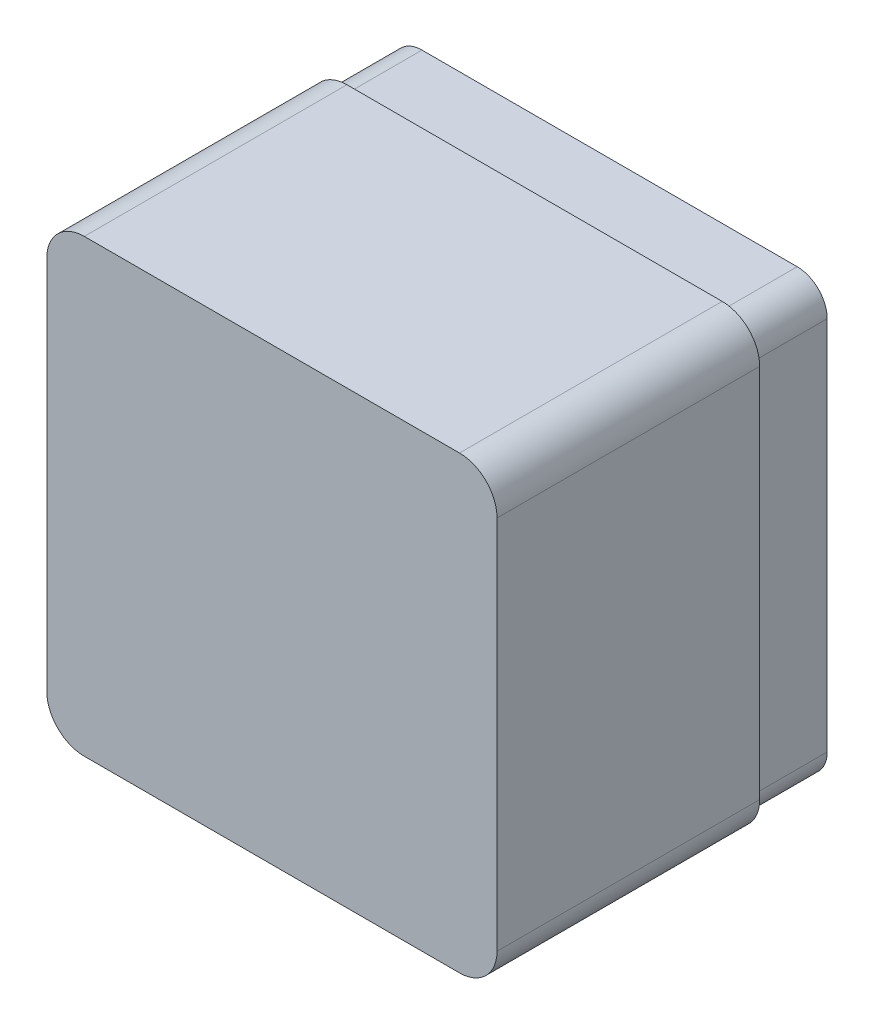
ISO-10303-21;
HEADER;
FILE_DESCRIPTION(('STEP AP214'),'2;1');
FILE_NAME('part.step','',(''),(''),'','','');
FILE_SCHEMA(('AUTOMOTIVE_DESIGN { 1 0 10303 214 1 1 1 1 }'));
ENDSEC;
DATA;
#1=APPLICATION_CONTEXT('core data for automotive mechanical design processes');
#2=APPLICATION_PROTOCOL_DEFINITION('international standard','automotive_design',2000,#1);
#3=PRODUCT_CONTEXT('',#1,'mechanical');
#4=PRODUCT('Part','Part','',(#3));
#5=PRODUCT_RELATED_PRODUCT_CATEGORY('part','',(#4));
#6=PRODUCT_DEFINITION_FORMATION('','',#4);
#7=PRODUCT_DEFINITION_CONTEXT('part definition',#1,'design');
#8=PRODUCT_DEFINITION('design','',#6,#7);
#9=PRODUCT_DEFINITION_SHAPE('','',#8);
#10=(LENGTH_UNIT() NAMED_UNIT(*) SI_UNIT(.MILLI.,.METRE.));
#11=(NAMED_UNIT(*) PLANE_ANGLE_UNIT() SI_UNIT($,.RADIAN.));
#12=(NAMED_UNIT(*) SI_UNIT($,.STERADIAN.) SOLID_ANGLE_UNIT());
#13=UNCERTAINTY_MEASURE_WITH_UNIT(LENGTH_MEASURE(1.E-05),#10,'distance_accuracy_value','');
#14=(GEOMETRIC_REPRESENTATION_CONTEXT(3) GLOBAL_UNCERTAINTY_ASSIGNED_CONTEXT((#13)) GLOBAL_UNIT_ASSIGNED_CONTEXT((#10,
#11,#12)) REPRESENTATION_CONTEXT('',''));
#15=CARTESIAN_POINT('',(0.,0.,0.));
#16=DIRECTION('',(0.,0.,1.));
#17=DIRECTION('',(1.,0.,0.));
#18=AXIS2_PLACEMENT_3D('',#15,#16,#17);
#19=CARTESIAN_POINT('',(0.,0.,0.));
#20=DIRECTION('',(0.,0.,-1.));
#21=DIRECTION('',(-1.,0.,0.));
#22=AXIS2_PLACEMENT_3D('',#19,#20,#21);
#23=PLANE('',#22);
#24=CARTESIAN_POINT('',(10.,10.,0.));
#25=DIRECTION('',(0.,0.,-1.));
#26=DIRECTION('',(-1.,0.,0.));
#27=AXIS2_PLACEMENT_3D('',#24,#25,#26);
#28=CIRCLE('',#27,6.);
#29=CARTESIAN_POINT('',(10.,4.,0.));
#30=VERTEX_POINT('',#29);
#31=CARTESIAN_POINT('',(4.,9.99999999999999,0.));
#32=VERTEX_POINT('',#31);
#33=EDGE_CURVE('E371',#30,#32,#28,.T.);
#34=ORIENTED_EDGE('',*,*,#33,.F.);
#35=DIRECTION('',(1.,0.,0.));
#36=VECTOR('',#35,1.);
#37=CARTESIAN_POINT('',(0.,4.,0.));
#38=LINE('',#37,#36);
#39=CARTESIAN_POINT('',(110.,4.,0.));
#40=VERTEX_POINT('',#39);
#41=EDGE_CURVE('E418',#30,#40,#38,.T.);
#42=ORIENTED_EDGE('',*,*,#41,.T.);
#43=CARTESIAN_POINT('',(110.,10.,0.));
#44=DIRECTION('',(0.,0.,-1.));
#45=DIRECTION('',(-1.,0.,0.));
#46=AXIS2_PLACEMENT_3D('',#43,#44,#45);
#47=CIRCLE('',#46,6.);
#48=CARTESIAN_POINT('',(116.,10.,0.));
#49=VERTEX_POINT('',#48);
#50=EDGE_CURVE('E428',#49,#40,#47,.T.);
#51=ORIENTED_EDGE('',*,*,#50,.F.);
#52=DIRECTION('',(0.,1.,0.));
#53=VECTOR('',#52,1.);
#54=CARTESIAN_POINT('',(116.,0.,0.));
#55=LINE('',#54,#53);
#56=CARTESIAN_POINT('',(116.,110.,0.));
#57=VERTEX_POINT('',#56);
#58=EDGE_CURVE('E425',#49,#57,#55,.T.);
#59=ORIENTED_EDGE('',*,*,#58,.T.);
#60=CARTESIAN_POINT('',(110.,110.,0.));
#61=DIRECTION('',(0.,0.,-1.));
#62=DIRECTION('',(-1.,0.,0.));
#63=AXIS2_PLACEMENT_3D('',#60,#61,#62);
#64=CIRCLE('',#63,6.);
#65=CARTESIAN_POINT('',(110.,116.,0.));
#66=VERTEX_POINT('',#65);
#67=EDGE_CURVE('E421',#66,#57,#64,.T.);
#68=ORIENTED_EDGE('',*,*,#67,.F.);
#69=DIRECTION('',(-1.,0.,0.));
#70=VECTOR('',#69,1.);
#71=CARTESIAN_POINT('',(0.,116.,0.));
#72=LINE('',#71,#70);
#73=CARTESIAN_POINT('',(9.99999999999999,116.,0.));
#74=VERTEX_POINT('',#73);
#75=EDGE_CURVE('E368',#66,#74,#72,.T.);
#76=ORIENTED_EDGE('',*,*,#75,.T.);
#77=CARTESIAN_POINT('',(10.,110.,0.));
#78=DIRECTION('',(0.,0.,-1.));
#79=DIRECTION('',(-1.,0.,0.));
#80=AXIS2_PLACEMENT_3D('',#77,#78,#79);
#81=CIRCLE('',#80,6.);
#82=CARTESIAN_POINT('',(4.,110.,0.));
#83=VERTEX_POINT('',#82);
#84=EDGE_CURVE('E399',#83,#74,#81,.T.);
#85=ORIENTED_EDGE('',*,*,#84,.F.);
#86=DIRECTION('',(0.,-1.,0.));
#87=VECTOR('',#86,1.);
#88=CARTESIAN_POINT('',(4.,0.,0.));
#89=LINE('',#88,#87);
#90=EDGE_CURVE('E357',#83,#32,#89,.T.);
#91=ORIENTED_EDGE('',*,*,#90,.T.);
#92=EDGE_LOOP('',(#34,#42,#51,#59,#68,#76,#85,#91));
#93=FACE_BOUND('',#92,.T.);
#94=DIRECTION('',(0.,1.,0.));
#95=VECTOR('',#94,1.);
#96=CARTESIAN_POINT('',(2.,10.,0.));
#97=LINE('',#96,#95);
#98=CARTESIAN_POINT('',(2.,10.,0.));
#99=VERTEX_POINT('',#98);
#100=CARTESIAN_POINT('',(2.,110.,0.));
#101=VERTEX_POINT('',#100);
#102=EDGE_CURVE('E266',#99,#101,#97,.T.);
#103=ORIENTED_EDGE('',*,*,#102,.T.);
#104=CARTESIAN_POINT('',(10.,110.,0.));
#105=DIRECTION('',(0.,0.,-1.));
#106=DIRECTION('',(-1.,0.,0.));
#107=AXIS2_PLACEMENT_3D('',#104,#105,#106);
#108=CIRCLE('',#107,8.);
#109=CARTESIAN_POINT('',(10.,118.,0.));
#110=VERTEX_POINT('',#109);
#111=EDGE_CURVE('E293',#101,#110,#108,.T.);
#112=ORIENTED_EDGE('',*,*,#111,.T.);
#113=DIRECTION('',(1.,0.,0.));
#114=VECTOR('',#113,1.);
#115=CARTESIAN_POINT('',(10.,118.,0.));
#116=LINE('',#115,#114);
#117=CARTESIAN_POINT('',(110.,118.,0.));
#118=VERTEX_POINT('',#117);
#119=EDGE_CURVE('E243',#110,#118,#116,.T.);
#120=ORIENTED_EDGE('',*,*,#119,.T.);
#121=CARTESIAN_POINT('',(110.,110.,0.));
#122=DIRECTION('',(0.,0.,-1.));
#123=DIRECTION('',(-1.,0.,0.));
#124=AXIS2_PLACEMENT_3D('',#121,#122,#123);
#125=CIRCLE('',#124,7.99999999999999);
#126=CARTESIAN_POINT('',(118.,110.,0.));
#127=VERTEX_POINT('',#126);
#128=EDGE_CURVE('E92',#118,#127,#125,.T.);
#129=ORIENTED_EDGE('',*,*,#128,.T.);
#130=DIRECTION('',(0.,-1.,0.));
#131=VECTOR('',#130,1.);
#132=CARTESIAN_POINT('',(118.,110.,0.));
#133=LINE('',#132,#131);
#134=CARTESIAN_POINT('',(118.,9.99999999999999,0.));
#135=VERTEX_POINT('',#134);
#136=EDGE_CURVE('E300',#127,#135,#133,.T.);
#137=ORIENTED_EDGE('',*,*,#136,.T.);
#138=CARTESIAN_POINT('',(110.,10.,0.));
#139=DIRECTION('',(0.,0.,-1.));
#140=DIRECTION('',(-1.,0.,0.));
#141=AXIS2_PLACEMENT_3D('',#138,#139,#140);
#142=CIRCLE('',#141,7.99999999999999);
#143=CARTESIAN_POINT('',(110.,2.,0.));
#144=VERTEX_POINT('',#143);
#145=EDGE_CURVE('E304',#135,#144,#142,.T.);
#146=ORIENTED_EDGE('',*,*,#145,.T.);
#147=DIRECTION('',(-1.,0.,0.));
#148=VECTOR('',#147,1.);
#149=CARTESIAN_POINT('',(110.,2.,0.));
#150=LINE('',#149,#148);
#151=CARTESIAN_POINT('',(9.99999999999999,2.,0.));
#152=VERTEX_POINT('',#151);
#153=EDGE_CURVE('E308',#144,#152,#150,.T.);
#154=ORIENTED_EDGE('',*,*,#153,.T.);
#155=CARTESIAN_POINT('',(10.,10.,0.));
#156=DIRECTION('',(0.,0.,-1.));
#157=DIRECTION('',(-1.,0.,0.));
#158=AXIS2_PLACEMENT_3D('',#155,#156,#157);
#159=CIRCLE('',#158,8.);
#160=EDGE_CURVE('E270',#152,#99,#159,.T.);
#161=ORIENTED_EDGE('',*,*,#160,.T.);
#162=EDGE_LOOP('',(#103,#112,#120,#129,#137,#146,#154,#161));
#163=FACE_BOUND('',#162,.T.);
#164=ADVANCED_FACE('F76',(#93,#163),#23,.T.);
#165=CARTESIAN_POINT('',(4.,0.,90.));
#166=DIRECTION('',(1.,0.,0.));
#167=DIRECTION('',(0.,0.,-1.));
#168=AXIS2_PLACEMENT_3D('',#165,#166,#167);
#169=PLANE('',#168);
#170=ORIENTED_EDGE('',*,*,#90,.F.);
#171=DIRECTION('',(0.,0.,-1.));
#172=VECTOR('',#171,1.);
#173=CARTESIAN_POINT('',(4.,110.,90.));
#174=LINE('',#173,#172);
#175=CARTESIAN_POINT('',(4.,110.,86.));
#176=VERTEX_POINT('',#175);
#177=EDGE_CURVE('E362',#176,#83,#174,.T.);
#178=ORIENTED_EDGE('',*,*,#177,.F.);
#179=DIRECTION('',(0.,-1.,0.));
#180=VECTOR('',#179,1.);
#181=CARTESIAN_POINT('',(4.,0.,86.));
#182=LINE('',#181,#180);
#183=CARTESIAN_POINT('',(4.,9.99999999999999,86.));
#184=VERTEX_POINT('',#183);
#185=EDGE_CURVE('E363',#176,#184,#182,.T.);
#186=ORIENTED_EDGE('',*,*,#185,.T.);
#187=DIRECTION('',(0.,0.,-1.));
#188=VECTOR('',#187,1.);
#189=CARTESIAN_POINT('',(4.,9.99999999999999,90.));
#190=LINE('',#189,#188);
#191=EDGE_CURVE('E358',#32,#184,#190,.F.);
#192=ORIENTED_EDGE('',*,*,#191,.F.);
#193=EDGE_LOOP('',(#170,#178,#186,#192));
#194=FACE_BOUND('',#193,.T.);
#195=ADVANCED_FACE('F539',(#194),#169,.T.);
#196=CARTESIAN_POINT('',(0.,4.,90.));
#197=DIRECTION('',(0.,1.,0.));
#198=DIRECTION('',(0.,0.,1.));
#199=AXIS2_PLACEMENT_3D('',#196,#197,#198);
#200=PLANE('',#199);
#201=DIRECTION('',(1.,0.,0.));
#202=VECTOR('',#201,1.);
#203=CARTESIAN_POINT('',(0.,4.,86.));
#204=LINE('',#203,#202);
#205=CARTESIAN_POINT('',(9.99999999999999,4.,86.));
#206=VERTEX_POINT('',#205);
#207=CARTESIAN_POINT('',(110.,4.,86.));
#208=VERTEX_POINT('',#207);
#209=EDGE_CURVE('E367',#206,#208,#204,.T.);
#210=ORIENTED_EDGE('',*,*,#209,.T.);
#211=DIRECTION('',(0.,0.,1.));
#212=VECTOR('',#211,1.);
#213=CARTESIAN_POINT('',(110.,4.,90.));
#214=LINE('',#213,#212);
#215=EDGE_CURVE('E393',#40,#208,#214,.T.);
#216=ORIENTED_EDGE('',*,*,#215,.F.);
#217=ORIENTED_EDGE('',*,*,#41,.F.);
#218=DIRECTION('',(0.,0.,1.));
#219=VECTOR('',#218,1.);
#220=CARTESIAN_POINT('',(9.99999999999999,4.,90.));
#221=LINE('',#220,#219);
#222=EDGE_CURVE('E396',#206,#30,#221,.F.);
#223=ORIENTED_EDGE('',*,*,#222,.F.);
#224=EDGE_LOOP('',(#210,#216,#217,#223));
#225=FACE_BOUND('',#224,.T.);
#226=ADVANCED_FACE('F544',(#225),#200,.T.);
#227=CARTESIAN_POINT('',(116.,0.,90.));
#228=DIRECTION('',(-1.,0.,0.));
#229=DIRECTION('',(0.,0.,1.));
#230=AXIS2_PLACEMENT_3D('',#227,#228,#229);
#231=PLANE('',#230);
#232=DIRECTION('',(0.,1.,0.));
#233=VECTOR('',#232,1.);
#234=CARTESIAN_POINT('',(116.,0.,86.));
#235=LINE('',#234,#233);
#236=CARTESIAN_POINT('',(116.,9.99999999999999,86.));
#237=VERTEX_POINT('',#236);
#238=CARTESIAN_POINT('',(116.,110.,86.));
#239=VERTEX_POINT('',#238);
#240=EDGE_CURVE('E380',#237,#239,#235,.T.);
#241=ORIENTED_EDGE('',*,*,#240,.T.);
#242=DIRECTION('',(0.,0.,1.));
#243=VECTOR('',#242,1.);
#244=CARTESIAN_POINT('',(116.,110.,90.));
#245=LINE('',#244,#243);
#246=EDGE_CURVE('E375',#57,#239,#245,.T.);
#247=ORIENTED_EDGE('',*,*,#246,.F.);
#248=ORIENTED_EDGE('',*,*,#58,.F.);
#249=DIRECTION('',(0.,0.,1.));
#250=VECTOR('',#249,1.);
#251=CARTESIAN_POINT('',(116.,9.99999999999999,90.));
#252=LINE('',#251,#250);
#253=EDGE_CURVE('E402',#237,#49,#252,.F.);
#254=ORIENTED_EDGE('',*,*,#253,.F.);
#255=EDGE_LOOP('',(#241,#247,#248,#254));
#256=FACE_BOUND('',#255,.T.);
#257=ADVANCED_FACE('F732',(#256),#231,.T.);
#258=CARTESIAN_POINT('',(0.,116.,90.));
#259=DIRECTION('',(0.,-1.,0.));
#260=DIRECTION('',(0.,0.,-1.));
#261=AXIS2_PLACEMENT_3D('',#258,#259,#260);
#262=PLANE('',#261);
#263=DIRECTION('',(-1.,0.,0.));
#264=VECTOR('',#263,1.);
#265=CARTESIAN_POINT('',(0.,116.,86.));
#266=LINE('',#265,#264);
#267=CARTESIAN_POINT('',(110.,116.,86.));
#268=VERTEX_POINT('',#267);
#269=CARTESIAN_POINT('',(9.99999999999999,116.,86.));
#270=VERTEX_POINT('',#269);
#271=EDGE_CURVE('E387',#268,#270,#266,.T.);
#272=ORIENTED_EDGE('',*,*,#271,.T.);
#273=DIRECTION('',(0.,0.,-1.));
#274=VECTOR('',#273,1.);
#275=CARTESIAN_POINT('',(9.99999999999999,116.,90.));
#276=LINE('',#275,#274);
#277=EDGE_CURVE('E406',#74,#270,#276,.F.);
#278=ORIENTED_EDGE('',*,*,#277,.F.);
#279=ORIENTED_EDGE('',*,*,#75,.F.);
#280=DIRECTION('',(0.,0.,-1.));
#281=VECTOR('',#280,1.);
#282=CARTESIAN_POINT('',(110.,116.,90.));
#283=LINE('',#282,#281);
#284=EDGE_CURVE('E409',#268,#66,#283,.T.);
#285=ORIENTED_EDGE('',*,*,#284,.F.);
#286=EDGE_LOOP('',(#272,#278,#279,#285));
#287=FACE_BOUND('',#286,.T.);
#288=ADVANCED_FACE('F723',(#287),#262,.T.);
#289=CARTESIAN_POINT('',(0.,0.,86.));
#290=DIRECTION('',(0.,0.,-1.));
#291=DIRECTION('',(-1.,0.,0.));
#292=AXIS2_PLACEMENT_3D('',#289,#290,#291);
#293=PLANE('',#292);
#294=ORIENTED_EDGE('',*,*,#185,.F.);
#295=CARTESIAN_POINT('',(10.,110.,86.));
#296=DIRECTION('',(0.,0.,-1.));
#297=DIRECTION('',(-1.,0.,0.));
#298=AXIS2_PLACEMENT_3D('',#295,#296,#297);
#299=CIRCLE('',#298,6.);
#300=EDGE_CURVE('E361',#270,#176,#299,.F.);
#301=ORIENTED_EDGE('',*,*,#300,.F.);
#302=ORIENTED_EDGE('',*,*,#271,.F.);
#303=CARTESIAN_POINT('',(110.,110.,86.));
#304=DIRECTION('',(0.,0.,-1.));
#305=DIRECTION('',(-1.,0.,0.));
#306=AXIS2_PLACEMENT_3D('',#303,#304,#305);
#307=CIRCLE('',#306,6.);
#308=EDGE_CURVE('E383',#239,#268,#307,.F.);
#309=ORIENTED_EDGE('',*,*,#308,.F.);
#310=ORIENTED_EDGE('',*,*,#240,.F.);
#311=CARTESIAN_POINT('',(110.,10.,86.));
#312=DIRECTION('',(0.,0.,-1.));
#313=DIRECTION('',(-1.,0.,0.));
#314=AXIS2_PLACEMENT_3D('',#311,#312,#313);
#315=CIRCLE('',#314,6.);
#316=EDGE_CURVE('E376',#208,#237,#315,.F.);
#317=ORIENTED_EDGE('',*,*,#316,.F.);
#318=ORIENTED_EDGE('',*,*,#209,.F.);
#319=CARTESIAN_POINT('',(10.,10.,86.));
#320=DIRECTION('',(0.,0.,-1.));
#321=DIRECTION('',(-1.,0.,0.));
#322=AXIS2_PLACEMENT_3D('',#319,#320,#321);
#323=CIRCLE('',#322,6.);
#324=EDGE_CURVE('E372',#184,#206,#323,.F.);
#325=ORIENTED_EDGE('',*,*,#324,.F.);
#326=EDGE_LOOP('',(#294,#301,#302,#309,#310,#317,#318,#325));
#327=FACE_BOUND('',#326,.T.);
#328=ADVANCED_FACE('F714',(#327),#293,.T.);
#329=CARTESIAN_POINT('',(10.,10.,90.));
#330=DIRECTION('',(0.,0.,-1.));
#331=DIRECTION('',(-1.,0.,0.));
#332=AXIS2_PLACEMENT_3D('',#329,#330,#331);
#333=CYLINDRICAL_SURFACE('',#332,6.);
#334=ORIENTED_EDGE('',*,*,#324,.T.);
#335=ORIENTED_EDGE('',*,*,#222,.T.);
#336=ORIENTED_EDGE('',*,*,#33,.T.);
#337=ORIENTED_EDGE('',*,*,#191,.T.);
#338=EDGE_LOOP('',(#334,#335,#336,#337));
#339=FACE_BOUND('',#338,.T.);
#340=ADVANCED_FACE('F705',(#339),#333,.F.);
#341=CARTESIAN_POINT('',(110.,10.,90.));
#342=DIRECTION('',(0.,0.,-1.));
#343=DIRECTION('',(-1.,0.,0.));
#344=AXIS2_PLACEMENT_3D('',#341,#342,#343);
#345=CYLINDRICAL_SURFACE('',#344,6.);
#346=ORIENTED_EDGE('',*,*,#316,.T.);
#347=ORIENTED_EDGE('',*,*,#253,.T.);
#348=ORIENTED_EDGE('',*,*,#50,.T.);
#349=ORIENTED_EDGE('',*,*,#215,.T.);
#350=EDGE_LOOP('',(#346,#347,#348,#349));
#351=FACE_BOUND('',#350,.T.);
#352=ADVANCED_FACE('F696',(#351),#345,.F.);
#353=CARTESIAN_POINT('',(110.,110.,90.));
#354=DIRECTION('',(0.,0.,-1.));
#355=DIRECTION('',(-1.,0.,0.));
#356=AXIS2_PLACEMENT_3D('',#353,#354,#355);
#357=CYLINDRICAL_SURFACE('',#356,6.);
#358=ORIENTED_EDGE('',*,*,#308,.T.);
#359=ORIENTED_EDGE('',*,*,#284,.T.);
#360=ORIENTED_EDGE('',*,*,#67,.T.);
#361=ORIENTED_EDGE('',*,*,#246,.T.);
#362=EDGE_LOOP('',(#358,#359,#360,#361));
#363=FACE_BOUND('',#362,.T.);
#364=ADVANCED_FACE('F688',(#363),#357,.F.);
#365=CARTESIAN_POINT('',(10.,110.,90.));
#366=DIRECTION('',(0.,0.,-1.));
#367=DIRECTION('',(-1.,0.,0.));
#368=AXIS2_PLACEMENT_3D('',#365,#366,#367);
#369=CYLINDRICAL_SURFACE('',#368,6.);
#370=ORIENTED_EDGE('',*,*,#300,.T.);
#371=ORIENTED_EDGE('',*,*,#177,.T.);
#372=ORIENTED_EDGE('',*,*,#84,.T.);
#373=ORIENTED_EDGE('',*,*,#277,.T.);
#374=EDGE_LOOP('',(#370,#371,#372,#373));
#375=FACE_BOUND('',#374,.T.);
#376=ADVANCED_FACE('F598',(#375),#369,.F.);
#377=CARTESIAN_POINT('',(60.,60.,20.));
#378=DIRECTION('',(0.,0.,-1.));
#379=DIRECTION('',(-1.,0.,0.));
#380=AXIS2_PLACEMENT_3D('',#377,#378,#379);
#381=PLANE('',#380);
#382=DIRECTION('',(-1.,0.,0.));
#383=VECTOR('',#382,1.);
#384=CARTESIAN_POINT('',(0.,0.,20.));
#385=LINE('',#384,#383);
#386=CARTESIAN_POINT('',(110.,0.,20.));
#387=VERTEX_POINT('',#386);
#388=CARTESIAN_POINT('',(10.,0.,20.));
#389=VERTEX_POINT('',#388);
#390=EDGE_CURVE('E350',#387,#389,#385,.T.);
#391=ORIENTED_EDGE('',*,*,#390,.T.);
#392=CARTESIAN_POINT('',(10.,10.,20.));
#393=DIRECTION('',(0.,0.,-1.));
#394=DIRECTION('',(-1.,0.,0.));
#395=AXIS2_PLACEMENT_3D('',#392,#393,#394);
#396=CIRCLE('',#395,10.);
#397=CARTESIAN_POINT('',(0.,10.,20.));
#398=VERTEX_POINT('',#397);
#399=EDGE_CURVE('E343',#398,#389,#396,.F.);
#400=ORIENTED_EDGE('',*,*,#399,.F.);
#401=DIRECTION('',(0.,1.,0.));
#402=VECTOR('',#401,1.);
#403=CARTESIAN_POINT('',(0.,0.,20.));
#404=LINE('',#403,#402);
#405=CARTESIAN_POINT('',(0.,110.,20.));
#406=VERTEX_POINT('',#405);
#407=EDGE_CURVE('E100',#398,#406,#404,.T.);
#408=ORIENTED_EDGE('',*,*,#407,.T.);
#409=CARTESIAN_POINT('',(10.,110.,20.));
#410=DIRECTION('',(0.,0.,-1.));
#411=DIRECTION('',(-1.,0.,0.));
#412=AXIS2_PLACEMENT_3D('',#409,#410,#411);
#413=CIRCLE('',#412,10.);
#414=CARTESIAN_POINT('',(10.,120.,20.));
#415=VERTEX_POINT('',#414);
#416=EDGE_CURVE('E13',#415,#406,#413,.F.);
#417=ORIENTED_EDGE('',*,*,#416,.F.);
#418=DIRECTION('',(1.,0.,0.));
#419=VECTOR('',#418,1.);
#420=CARTESIAN_POINT('',(0.,120.,20.));
#421=LINE('',#420,#419);
#422=CARTESIAN_POINT('',(110.,120.,20.));
#423=VERTEX_POINT('',#422);
#424=EDGE_CURVE('E317',#415,#423,#421,.T.);
#425=ORIENTED_EDGE('',*,*,#424,.T.);
#426=CARTESIAN_POINT('',(110.,110.,20.));
#427=DIRECTION('',(0.,0.,-1.));
#428=DIRECTION('',(-1.,0.,0.));
#429=AXIS2_PLACEMENT_3D('',#426,#427,#428);
#430=CIRCLE('',#429,10.);
#431=CARTESIAN_POINT('',(120.,110.,20.));
#432=VERTEX_POINT('',#431);
#433=EDGE_CURVE('E339',#432,#423,#430,.F.);
#434=ORIENTED_EDGE('',*,*,#433,.F.);
#435=DIRECTION('',(0.,-1.,0.));
#436=VECTOR('',#435,1.);
#437=CARTESIAN_POINT('',(120.,0.,20.));
#438=LINE('',#437,#436);
#439=CARTESIAN_POINT('',(120.,10.,20.));
#440=VERTEX_POINT('',#439);
#441=EDGE_CURVE('E347',#432,#440,#438,.T.);
#442=ORIENTED_EDGE('',*,*,#441,.T.);
#443=CARTESIAN_POINT('',(110.,10.,20.));
#444=DIRECTION('',(0.,0.,-1.));
#445=DIRECTION('',(-1.,0.,0.));
#446=AXIS2_PLACEMENT_3D('',#443,#444,#445);
#447=CIRCLE('',#446,10.);
#448=EDGE_CURVE('E353',#387,#440,#447,.F.);
#449=ORIENTED_EDGE('',*,*,#448,.F.);
#450=EDGE_LOOP('',(#391,#400,#408,#417,#425,#434,#442,#449));
#451=FACE_BOUND('',#450,.T.);
#452=DIRECTION('',(0.,1.,0.));
#453=VECTOR('',#452,1.);
#454=CARTESIAN_POINT('',(2.,10.,20.));
#455=LINE('',#454,#453);
#456=CARTESIAN_POINT('',(2.,10.,20.));
#457=VERTEX_POINT('',#456);
#458=CARTESIAN_POINT('',(2.,110.,20.));
#459=VERTEX_POINT('',#458);
#460=EDGE_CURVE('E250',#457,#459,#455,.T.);
#461=ORIENTED_EDGE('',*,*,#460,.F.);
#462=CARTESIAN_POINT('',(10.,10.,20.));
#463=DIRECTION('',(0.,0.,-1.));
#464=DIRECTION('',(-1.,0.,0.));
#465=AXIS2_PLACEMENT_3D('',#462,#463,#464);
#466=CIRCLE('',#465,8.);
#467=CARTESIAN_POINT('',(9.99999999999999,2.,20.));
#468=VERTEX_POINT('',#467);
#469=EDGE_CURVE('E287',#468,#457,#466,.T.);
#470=ORIENTED_EDGE('',*,*,#469,.F.);
#471=DIRECTION('',(-1.,0.,0.));
#472=VECTOR('',#471,1.);
#473=CARTESIAN_POINT('',(110.,2.,20.));
#474=LINE('',#473,#472);
#475=CARTESIAN_POINT('',(110.,2.,20.));
#476=VERTEX_POINT('',#475);
#477=EDGE_CURVE('E283',#476,#468,#474,.T.);
#478=ORIENTED_EDGE('',*,*,#477,.F.);
#479=CARTESIAN_POINT('',(110.,10.,20.));
#480=DIRECTION('',(0.,0.,-1.));
#481=DIRECTION('',(-1.,0.,0.));
#482=AXIS2_PLACEMENT_3D('',#479,#480,#481);
#483=CIRCLE('',#482,7.99999999999999);
#484=CARTESIAN_POINT('',(118.,9.99999999999999,20.));
#485=VERTEX_POINT('',#484);
#486=EDGE_CURVE('E279',#485,#476,#483,.T.);
#487=ORIENTED_EDGE('',*,*,#486,.F.);
#488=DIRECTION('',(0.,-1.,0.));
#489=VECTOR('',#488,1.);
#490=CARTESIAN_POINT('',(118.,110.,20.));
#491=LINE('',#490,#489);
#492=CARTESIAN_POINT('',(118.,110.,20.));
#493=VERTEX_POINT('',#492);
#494=EDGE_CURVE('E275',#493,#485,#491,.T.);
#495=ORIENTED_EDGE('',*,*,#494,.F.);
#496=CARTESIAN_POINT('',(110.,110.,20.));
#497=DIRECTION('',(0.,0.,-1.));
#498=DIRECTION('',(-1.,0.,0.));
#499=AXIS2_PLACEMENT_3D('',#496,#497,#498);
#500=CIRCLE('',#499,7.99999999999999);
#501=CARTESIAN_POINT('',(110.,118.,20.));
#502=VERTEX_POINT('',#501);
#503=EDGE_CURVE('E260',#502,#493,#500,.T.);
#504=ORIENTED_EDGE('',*,*,#503,.F.);
#505=DIRECTION('',(1.,0.,0.));
#506=VECTOR('',#505,1.);
#507=CARTESIAN_POINT('',(10.,118.,20.));
#508=LINE('',#507,#506);
#509=CARTESIAN_POINT('',(10.,118.,20.));
#510=VERTEX_POINT('',#509);
#511=EDGE_CURVE('E241',#510,#502,#508,.T.);
#512=ORIENTED_EDGE('',*,*,#511,.F.);
#513=CARTESIAN_POINT('',(10.,110.,20.));
#514=DIRECTION('',(0.,0.,-1.));
#515=DIRECTION('',(-1.,0.,0.));
#516=AXIS2_PLACEMENT_3D('',#513,#514,#515);
#517=CIRCLE('',#516,8.);
#518=EDGE_CURVE('E256',#459,#510,#517,.T.);
#519=ORIENTED_EDGE('',*,*,#518,.F.);
#520=EDGE_LOOP('',(#461,#470,#478,#487,#495,#504,#512,#519));
#521=FACE_BOUND('',#520,.T.);
#522=ADVANCED_FACE('F255',(#451,#521),#381,.T.);
#523=CARTESIAN_POINT('',(10.,110.,20.));
#524=DIRECTION('',(0.,0.,-1.));
#525=DIRECTION('',(-1.,0.,0.));
#526=AXIS2_PLACEMENT_3D('',#523,#524,#525);
#527=CYLINDRICAL_SURFACE('',#526,8.);
#528=ORIENTED_EDGE('',*,*,#111,.F.);
#529=DIRECTION('',(0.,0.,-1.));
#530=VECTOR('',#529,1.);
#531=CARTESIAN_POINT('',(2.,110.,20.));
#532=LINE('',#531,#530);
#533=EDGE_CURVE('E264',#459,#101,#532,.T.);
#534=ORIENTED_EDGE('',*,*,#533,.F.);
#535=ORIENTED_EDGE('',*,*,#518,.T.);
#536=DIRECTION('',(0.,0.,-1.));
#537=VECTOR('',#536,1.);
#538=CARTESIAN_POINT('',(10.,118.,20.));
#539=LINE('',#538,#537);
#540=EDGE_CURVE('E238',#510,#110,#539,.T.);
#541=ORIENTED_EDGE('',*,*,#540,.T.);
#542=EDGE_LOOP('',(#528,#534,#535,#541));
#543=FACE_BOUND('',#542,.T.);
#544=ADVANCED_FACE('F263',(#543),#527,.T.);
#545=CARTESIAN_POINT('',(2.,10.,20.));
#546=DIRECTION('',(-1.,0.,0.));
#547=DIRECTION('',(0.,-1.,0.));
#548=AXIS2_PLACEMENT_3D('',#545,#546,#547);
#549=PLANE('',#548);
#550=ORIENTED_EDGE('',*,*,#102,.F.);
#551=DIRECTION('',(0.,0.,-1.));
#552=VECTOR('',#551,1.);
#553=CARTESIAN_POINT('',(2.,10.,20.));
#554=LINE('',#553,#552);
#555=EDGE_CURVE('E318',#457,#99,#554,.T.);
#556=ORIENTED_EDGE('',*,*,#555,.F.);
#557=ORIENTED_EDGE('',*,*,#460,.T.);
#558=ORIENTED_EDGE('',*,*,#533,.T.);
#559=EDGE_LOOP('',(#550,#556,#557,#558));
#560=FACE_BOUND('',#559,.T.);
#561=ADVANCED_FACE('F606',(#560),#549,.T.);
#562=CARTESIAN_POINT('',(10.,10.,20.));
#563=DIRECTION('',(0.,0.,-1.));
#564=DIRECTION('',(-1.,0.,0.));
#565=AXIS2_PLACEMENT_3D('',#562,#563,#564);
#566=CYLINDRICAL_SURFACE('',#565,8.);
#567=ORIENTED_EDGE('',*,*,#160,.F.);
#568=DIRECTION('',(0.,0.,-1.));
#569=VECTOR('',#568,1.);
#570=CARTESIAN_POINT('',(9.99999999999999,2.,20.));
#571=LINE('',#570,#569);
#572=EDGE_CURVE('E321',#468,#152,#571,.T.);
#573=ORIENTED_EDGE('',*,*,#572,.F.);
#574=ORIENTED_EDGE('',*,*,#469,.T.);
#575=ORIENTED_EDGE('',*,*,#555,.T.);
#576=EDGE_LOOP('',(#567,#573,#574,#575));
#577=FACE_BOUND('',#576,.T.);
#578=ADVANCED_FACE('F614',(#577),#566,.T.);
#579=CARTESIAN_POINT('',(110.,2.,20.));
#580=DIRECTION('',(0.,-1.,0.));
#581=DIRECTION('',(0.,0.,-1.));
#582=AXIS2_PLACEMENT_3D('',#579,#580,#581);
#583=PLANE('',#582);
#584=ORIENTED_EDGE('',*,*,#153,.F.);
#585=DIRECTION('',(0.,0.,-1.));
#586=VECTOR('',#585,1.);
#587=CARTESIAN_POINT('',(110.,2.,20.));
#588=LINE('',#587,#586);
#589=EDGE_CURVE('E324',#476,#144,#588,.T.);
#590=ORIENTED_EDGE('',*,*,#589,.F.);
#591=ORIENTED_EDGE('',*,*,#477,.T.);
#592=ORIENTED_EDGE('',*,*,#572,.T.);
#593=EDGE_LOOP('',(#584,#590,#591,#592));
#594=FACE_BOUND('',#593,.T.);
#595=ADVANCED_FACE('F623',(#594),#583,.T.);
#596=CARTESIAN_POINT('',(110.,10.,20.));
#597=DIRECTION('',(0.,0.,-1.));
#598=DIRECTION('',(-1.,0.,0.));
#599=AXIS2_PLACEMENT_3D('',#596,#597,#598);
#600=CYLINDRICAL_SURFACE('',#599,7.99999999999999);
#601=ORIENTED_EDGE('',*,*,#145,.F.);
#602=DIRECTION('',(0.,0.,-1.));
#603=VECTOR('',#602,1.);
#604=CARTESIAN_POINT('',(118.,9.99999999999999,20.));
#605=LINE('',#604,#603);
#606=EDGE_CURVE('E327',#485,#135,#605,.T.);
#607=ORIENTED_EDGE('',*,*,#606,.F.);
#608=ORIENTED_EDGE('',*,*,#486,.T.);
#609=ORIENTED_EDGE('',*,*,#589,.T.);
#610=EDGE_LOOP('',(#601,#607,#608,#609));
#611=FACE_BOUND('',#610,.T.);
#612=ADVANCED_FACE('F632',(#611),#600,.T.);
#613=CARTESIAN_POINT('',(118.,110.,20.));
#614=DIRECTION('',(1.,0.,0.));
#615=DIRECTION('',(0.,0.,-1.));
#616=AXIS2_PLACEMENT_3D('',#613,#614,#615);
#617=PLANE('',#616);
#618=ORIENTED_EDGE('',*,*,#136,.F.);
#619=DIRECTION('',(0.,0.,-1.));
#620=VECTOR('',#619,1.);
#621=CARTESIAN_POINT('',(118.,110.,20.));
#622=LINE('',#621,#620);
#623=EDGE_CURVE('E330',#493,#127,#622,.T.);
#624=ORIENTED_EDGE('',*,*,#623,.F.);
#625=ORIENTED_EDGE('',*,*,#494,.T.);
#626=ORIENTED_EDGE('',*,*,#606,.T.);
#627=EDGE_LOOP('',(#618,#624,#625,#626));
#628=FACE_BOUND('',#627,.T.);
#629=ADVANCED_FACE('F641',(#628),#617,.T.);
#630=CARTESIAN_POINT('',(110.,110.,20.));
#631=DIRECTION('',(0.,0.,-1.));
#632=DIRECTION('',(-1.,0.,0.));
#633=AXIS2_PLACEMENT_3D('',#630,#631,#632);
#634=CYLINDRICAL_SURFACE('',#633,7.99999999999999);
#635=ORIENTED_EDGE('',*,*,#128,.F.);
#636=DIRECTION('',(0.,0.,-1.));
#637=VECTOR('',#636,1.);
#638=CARTESIAN_POINT('',(110.,118.,20.));
#639=LINE('',#638,#637);
#640=EDGE_CURVE('E249',#502,#118,#639,.T.);
#641=ORIENTED_EDGE('',*,*,#640,.F.);
#642=ORIENTED_EDGE('',*,*,#503,.T.);
#643=ORIENTED_EDGE('',*,*,#623,.T.);
#644=EDGE_LOOP('',(#635,#641,#642,#643));
#645=FACE_BOUND('',#644,.T.);
#646=ADVANCED_FACE('F534',(#645),#634,.T.);
#647=CARTESIAN_POINT('',(10.,118.,20.));
#648=DIRECTION('',(0.,1.,0.));
#649=DIRECTION('',(0.,0.,1.));
#650=AXIS2_PLACEMENT_3D('',#647,#648,#649);
#651=PLANE('',#650);
#652=ORIENTED_EDGE('',*,*,#119,.F.);
#653=ORIENTED_EDGE('',*,*,#540,.F.);
#654=ORIENTED_EDGE('',*,*,#511,.T.);
#655=ORIENTED_EDGE('',*,*,#640,.T.);
#656=EDGE_LOOP('',(#652,#653,#654,#655));
#657=FACE_BOUND('',#656,.T.);
#658=ADVANCED_FACE('F240',(#657),#651,.T.);
#659=CARTESIAN_POINT('',(0.,0.,90.));
#660=DIRECTION('',(0.,0.,-1.));
#661=DIRECTION('',(-1.,0.,0.));
#662=AXIS2_PLACEMENT_3D('',#659,#660,#661);
#663=PLANE('',#662);
#664=DIRECTION('',(0.,-1.,0.));
#665=VECTOR('',#664,1.);
#666=CARTESIAN_POINT('',(0.,0.,90.));
#667=LINE('',#666,#665);
#668=CARTESIAN_POINT('',(0.,110.,90.));
#669=VERTEX_POINT('',#668);
#670=CARTESIAN_POINT('',(0.,10.,90.));
#671=VERTEX_POINT('',#670);
#672=EDGE_CURVE('E412',#669,#671,#667,.T.);
#673=ORIENTED_EDGE('',*,*,#672,.T.);
#674=CARTESIAN_POINT('',(10.,10.,90.));
#675=DIRECTION('',(0.,0.,-1.));
#676=DIRECTION('',(-1.,0.,0.));
#677=AXIS2_PLACEMENT_3D('',#674,#675,#676);
#678=CIRCLE('',#677,10.);
#679=CARTESIAN_POINT('',(10.,0.,90.));
#680=VERTEX_POINT('',#679);
#681=EDGE_CURVE('E477',#671,#680,#678,.F.);
#682=ORIENTED_EDGE('',*,*,#681,.T.);
#683=DIRECTION('',(1.,0.,0.));
#684=VECTOR('',#683,1.);
#685=CARTESIAN_POINT('',(0.,0.,90.));
#686=LINE('',#685,#684);
#687=CARTESIAN_POINT('',(110.,0.,90.));
#688=VERTEX_POINT('',#687);
#689=EDGE_CURVE('E442',#680,#688,#686,.T.);
#690=ORIENTED_EDGE('',*,*,#689,.T.);
#691=CARTESIAN_POINT('',(110.,10.,90.));
#692=DIRECTION('',(0.,0.,-1.));
#693=DIRECTION('',(-1.,0.,0.));
#694=AXIS2_PLACEMENT_3D('',#691,#692,#693);
#695=CIRCLE('',#694,10.);
#696=CARTESIAN_POINT('',(120.,10.,90.));
#697=VERTEX_POINT('',#696);
#698=EDGE_CURVE('E474',#688,#697,#695,.F.);
#699=ORIENTED_EDGE('',*,*,#698,.T.);
#700=DIRECTION('',(0.,1.,0.));
#701=VECTOR('',#700,1.);
#702=CARTESIAN_POINT('',(120.,0.,90.));
#703=LINE('',#702,#701);
#704=CARTESIAN_POINT('',(120.,110.,90.));
#705=VERTEX_POINT('',#704);
#706=EDGE_CURVE('E446',#697,#705,#703,.T.);
#707=ORIENTED_EDGE('',*,*,#706,.T.);
#708=CARTESIAN_POINT('',(110.,110.,90.));
#709=DIRECTION('',(0.,0.,-1.));
#710=DIRECTION('',(-1.,0.,0.));
#711=AXIS2_PLACEMENT_3D('',#708,#709,#710);
#712=CIRCLE('',#711,10.);
#713=CARTESIAN_POINT('',(110.,120.,90.));
#714=VERTEX_POINT('',#713);
#715=EDGE_CURVE('E471',#705,#714,#712,.F.);
#716=ORIENTED_EDGE('',*,*,#715,.T.);
#717=DIRECTION('',(-1.,0.,0.));
#718=VECTOR('',#717,1.);
#719=CARTESIAN_POINT('',(0.,120.,90.));
#720=LINE('',#719,#718);
#721=CARTESIAN_POINT('',(10.,120.,90.));
#722=VERTEX_POINT('',#721);
#723=EDGE_CURVE('E450',#714,#722,#720,.T.);
#724=ORIENTED_EDGE('',*,*,#723,.T.);
#725=CARTESIAN_POINT('',(10.,110.,90.));
#726=DIRECTION('',(0.,0.,-1.));
#727=DIRECTION('',(-1.,0.,0.));
#728=AXIS2_PLACEMENT_3D('',#725,#726,#727);
#729=CIRCLE('',#728,10.);
#730=EDGE_CURVE('E468',#722,#669,#729,.F.);
#731=ORIENTED_EDGE('',*,*,#730,.T.);
#732=EDGE_LOOP('',(#673,#682,#690,#699,#707,#716,#724,#731));
#733=FACE_BOUND('',#732,.T.);
#734=ADVANCED_FACE('F526',(#733),#663,.F.);
#735=CARTESIAN_POINT('',(10.,10.,90.));
#736=DIRECTION('',(0.,0.,-1.));
#737=DIRECTION('',(-1.,0.,0.));
#738=AXIS2_PLACEMENT_3D('',#735,#736,#737);
#739=CYLINDRICAL_SURFACE('',#738,10.);
#740=DIRECTION('',(0.,0.,-1.));
#741=VECTOR('',#740,1.);
#742=CARTESIAN_POINT('',(0.,10.,90.));
#743=LINE('',#742,#741);
#744=EDGE_CURVE('E465',#398,#671,#743,.F.);
#745=ORIENTED_EDGE('',*,*,#744,.F.);
#746=ORIENTED_EDGE('',*,*,#399,.T.);
#747=DIRECTION('',(0.,0.,-1.));
#748=VECTOR('',#747,1.);
#749=CARTESIAN_POINT('',(10.,0.,90.));
#750=LINE('',#749,#748);
#751=EDGE_CURVE('E457',#680,#389,#750,.T.);
#752=ORIENTED_EDGE('',*,*,#751,.F.);
#753=ORIENTED_EDGE('',*,*,#681,.F.);
#754=EDGE_LOOP('',(#745,#746,#752,#753));
#755=FACE_BOUND('',#754,.T.);
#756=ADVANCED_FACE('F518',(#755),#739,.T.);
#757=CARTESIAN_POINT('',(110.,10.,90.));
#758=DIRECTION('',(0.,0.,-1.));
#759=DIRECTION('',(-1.,0.,0.));
#760=AXIS2_PLACEMENT_3D('',#757,#758,#759);
#761=CYLINDRICAL_SURFACE('',#760,10.);
#762=DIRECTION('',(0.,0.,-1.));
#763=VECTOR('',#762,1.);
#764=CARTESIAN_POINT('',(110.,0.,90.));
#765=LINE('',#764,#763);
#766=EDGE_CURVE('E454',#387,#688,#765,.F.);
#767=ORIENTED_EDGE('',*,*,#766,.F.);
#768=ORIENTED_EDGE('',*,*,#448,.T.);
#769=DIRECTION('',(0.,0.,-1.));
#770=VECTOR('',#769,1.);
#771=CARTESIAN_POINT('',(120.,10.,90.));
#772=LINE('',#771,#770);
#773=EDGE_CURVE('E483',#697,#440,#772,.T.);
#774=ORIENTED_EDGE('',*,*,#773,.F.);
#775=ORIENTED_EDGE('',*,*,#698,.F.);
#776=EDGE_LOOP('',(#767,#768,#774,#775));
#777=FACE_BOUND('',#776,.T.);
#778=ADVANCED_FACE('F509',(#777),#761,.T.);
#779=CARTESIAN_POINT('',(110.,110.,90.));
#780=DIRECTION('',(0.,0.,-1.));
#781=DIRECTION('',(-1.,0.,0.));
#782=AXIS2_PLACEMENT_3D('',#779,#780,#781);
#783=CYLINDRICAL_SURFACE('',#782,10.);
#784=DIRECTION('',(0.,0.,-1.));
#785=VECTOR('',#784,1.);
#786=CARTESIAN_POINT('',(120.,110.,90.));
#787=LINE('',#786,#785);
#788=EDGE_CURVE('E480',#432,#705,#787,.F.);
#789=ORIENTED_EDGE('',*,*,#788,.F.);
#790=ORIENTED_EDGE('',*,*,#433,.T.);
#791=DIRECTION('',(0.,0.,-1.));
#792=VECTOR('',#791,1.);
#793=CARTESIAN_POINT('',(110.,120.,90.));
#794=LINE('',#793,#792);
#795=EDGE_CURVE('E85',#714,#423,#794,.T.);
#796=ORIENTED_EDGE('',*,*,#795,.F.);
#797=ORIENTED_EDGE('',*,*,#715,.F.);
#798=EDGE_LOOP('',(#789,#790,#796,#797));
#799=FACE_BOUND('',#798,.T.);
#800=ADVANCED_FACE('F500',(#799),#783,.T.);
#801=CARTESIAN_POINT('',(10.,110.,90.));
#802=DIRECTION('',(0.,0.,-1.));
#803=DIRECTION('',(-1.,0.,0.));
#804=AXIS2_PLACEMENT_3D('',#801,#802,#803);
#805=CYLINDRICAL_SURFACE('',#804,10.);
#806=DIRECTION('',(0.,0.,-1.));
#807=VECTOR('',#806,1.);
#808=CARTESIAN_POINT('',(10.,120.,90.));
#809=LINE('',#808,#807);
#810=EDGE_CURVE('E487',#415,#722,#809,.F.);
#811=ORIENTED_EDGE('',*,*,#810,.F.);
#812=ORIENTED_EDGE('',*,*,#416,.T.);
#813=DIRECTION('',(0.,0.,-1.));
#814=VECTOR('',#813,1.);
#815=CARTESIAN_POINT('',(0.,110.,90.));
#816=LINE('',#815,#814);
#817=EDGE_CURVE('E461',#669,#406,#816,.T.);
#818=ORIENTED_EDGE('',*,*,#817,.F.);
#819=ORIENTED_EDGE('',*,*,#730,.F.);
#820=EDGE_LOOP('',(#811,#812,#818,#819));
#821=FACE_BOUND('',#820,.T.);
#822=ADVANCED_FACE('F78',(#821),#805,.T.);
#823=CARTESIAN_POINT('',(0.,120.,90.));
#824=DIRECTION('',(0.,-1.,0.));
#825=DIRECTION('',(0.,0.,-1.));
#826=AXIS2_PLACEMENT_3D('',#823,#824,#825);
#827=PLANE('',#826);
#828=ORIENTED_EDGE('',*,*,#424,.F.);
#829=ORIENTED_EDGE('',*,*,#810,.T.);
#830=ORIENTED_EDGE('',*,*,#723,.F.);
#831=ORIENTED_EDGE('',*,*,#795,.T.);
#832=EDGE_LOOP('',(#828,#829,#830,#831));
#833=FACE_BOUND('',#832,.T.);
#834=ADVANCED_FACE('F495',(#833),#827,.F.);
#835=CARTESIAN_POINT('',(120.,0.,90.));
#836=DIRECTION('',(-1.,0.,0.));
#837=DIRECTION('',(0.,0.,1.));
#838=AXIS2_PLACEMENT_3D('',#835,#836,#837);
#839=PLANE('',#838);
#840=ORIENTED_EDGE('',*,*,#441,.F.);
#841=ORIENTED_EDGE('',*,*,#788,.T.);
#842=ORIENTED_EDGE('',*,*,#706,.F.);
#843=ORIENTED_EDGE('',*,*,#773,.T.);
#844=EDGE_LOOP('',(#840,#841,#842,#843));
#845=FACE_BOUND('',#844,.T.);
#846=ADVANCED_FACE('F503',(#845),#839,.F.);
#847=CARTESIAN_POINT('',(0.,0.,90.));
#848=DIRECTION('',(0.,1.,0.));
#849=DIRECTION('',(0.,0.,1.));
#850=AXIS2_PLACEMENT_3D('',#847,#848,#849);
#851=PLANE('',#850);
#852=ORIENTED_EDGE('',*,*,#390,.F.);
#853=ORIENTED_EDGE('',*,*,#766,.T.);
#854=ORIENTED_EDGE('',*,*,#689,.F.);
#855=ORIENTED_EDGE('',*,*,#751,.T.);
#856=EDGE_LOOP('',(#852,#853,#854,#855));
#857=FACE_BOUND('',#856,.T.);
#858=ADVANCED_FACE('F512',(#857),#851,.F.);
#859=CARTESIAN_POINT('',(0.,0.,90.));
#860=DIRECTION('',(1.,0.,0.));
#861=DIRECTION('',(0.,0.,-1.));
#862=AXIS2_PLACEMENT_3D('',#859,#860,#861);
#863=PLANE('',#862);
#864=ORIENTED_EDGE('',*,*,#407,.F.);
#865=ORIENTED_EDGE('',*,*,#744,.T.);
#866=ORIENTED_EDGE('',*,*,#672,.F.);
#867=ORIENTED_EDGE('',*,*,#817,.T.);
#868=EDGE_LOOP('',(#864,#865,#866,#867));
#869=FACE_BOUND('',#868,.T.);
#870=ADVANCED_FACE('F520',(#869),#863,.F.);
#871=CLOSED_SHELL('',(#164,#195,#226,#257,#288,#328,#340,#352,#364,#376,#522,#544,#561,#578,
#595,#612,#629,#646,#658,#734,#756,#778,#800,#822,#834,#846,#858,#870));
#872=MANIFOLD_SOLID_BREP('B2',#871);
#873=ADVANCED_BREP_SHAPE_REPRESENTATION('',(#18,#872),#14);
#874=SHAPE_DEFINITION_REPRESENTATION(#9,#873);
ENDSEC;
END-ISO-10303-21;
